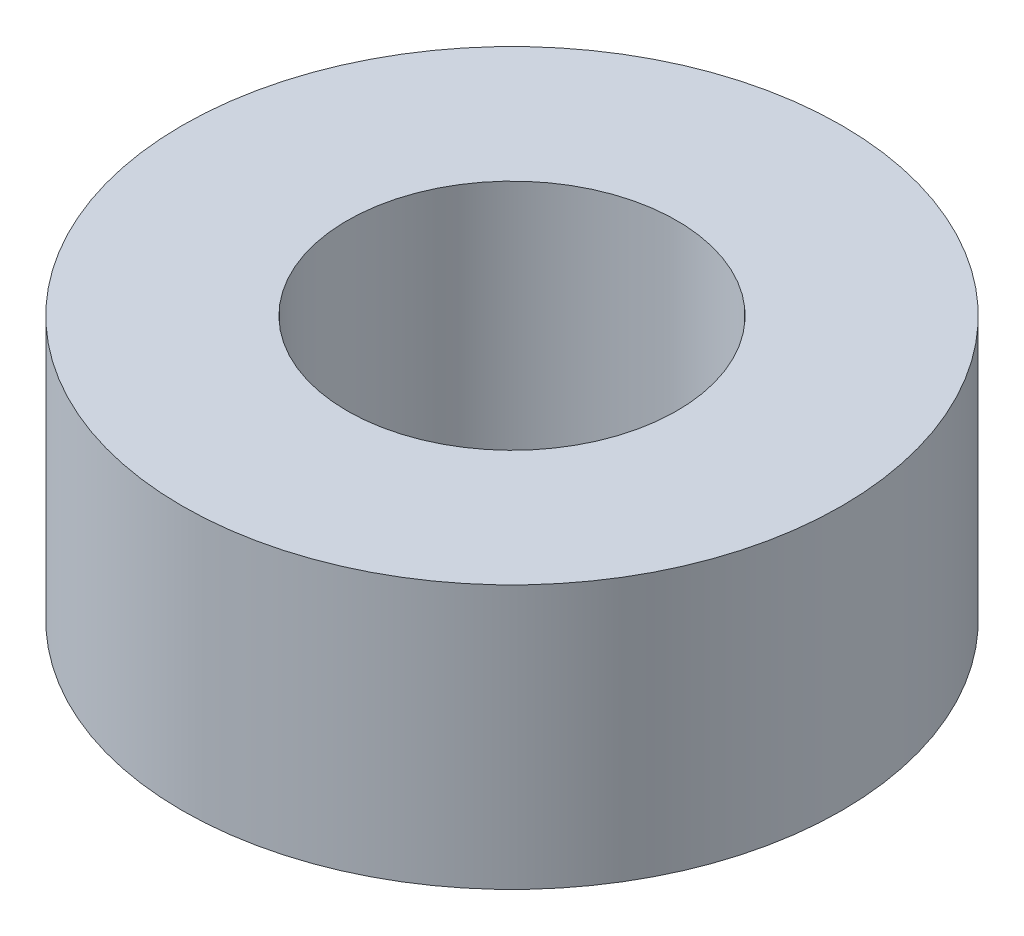
ISO-10303-21;
HEADER;
FILE_DESCRIPTION(('STEP AP214'),'2;1');
FILE_NAME('part.step','',(''),(''),'','','');
FILE_SCHEMA(('AUTOMOTIVE_DESIGN { 1 0 10303 214 1 1 1 1 }'));
ENDSEC;
DATA;
#1=APPLICATION_CONTEXT('core data for automotive mechanical design processes');
#2=APPLICATION_PROTOCOL_DEFINITION('international standard','automotive_design',2000,#1);
#3=PRODUCT_CONTEXT('',#1,'mechanical');
#4=PRODUCT('Part','Part','',(#3));
#5=PRODUCT_RELATED_PRODUCT_CATEGORY('part','',(#4));
#6=PRODUCT_DEFINITION_FORMATION('','',#4);
#7=PRODUCT_DEFINITION_CONTEXT('part definition',#1,'design');
#8=PRODUCT_DEFINITION('design','',#6,#7);
#9=PRODUCT_DEFINITION_SHAPE('','',#8);
#10=(LENGTH_UNIT() NAMED_UNIT(*) SI_UNIT(.MILLI.,.METRE.));
#11=(NAMED_UNIT(*) PLANE_ANGLE_UNIT() SI_UNIT($,.RADIAN.));
#12=(NAMED_UNIT(*) SI_UNIT($,.STERADIAN.) SOLID_ANGLE_UNIT());
#13=UNCERTAINTY_MEASURE_WITH_UNIT(LENGTH_MEASURE(1.E-05),#10,'distance_accuracy_value','');
#14=(GEOMETRIC_REPRESENTATION_CONTEXT(3) GLOBAL_UNCERTAINTY_ASSIGNED_CONTEXT((#13)) GLOBAL_UNIT_ASSIGNED_CONTEXT((#10,
#11,#12)) REPRESENTATION_CONTEXT('',''));
#15=CARTESIAN_POINT('',(0.,0.,0.));
#16=DIRECTION('',(0.,0.,1.));
#17=DIRECTION('',(1.,0.,0.));
#18=AXIS2_PLACEMENT_3D('',#15,#16,#17);
#19=CARTESIAN_POINT('',(0.,16.,0.));
#20=DIRECTION('',(0.,-1.,0.));
#21=DIRECTION('',(0.,0.,-1.));
#22=AXIS2_PLACEMENT_3D('',#19,#20,#21);
#23=CYLINDRICAL_SURFACE('',#22,20.);
#24=CARTESIAN_POINT('',(0.,16.,0.));
#25=DIRECTION('',(0.,1.,0.));
#26=DIRECTION('',(0.,0.,1.));
#27=AXIS2_PLACEMENT_3D('',#24,#25,#26);
#28=CIRCLE('',#27,20.);
#29=CARTESIAN_POINT('',(0.,16.,20.));
#30=VERTEX_POINT('',#29);
#31=EDGE_CURVE('E10',#30,#30,#28,.T.);
#32=ORIENTED_EDGE('',*,*,#31,.F.);
#33=EDGE_LOOP('',(#32));
#34=FACE_BOUND('',#33,.T.);
#35=CARTESIAN_POINT('',(0.,0.,0.));
#36=DIRECTION('',(0.,1.,0.));
#37=DIRECTION('',(0.,0.,1.));
#38=AXIS2_PLACEMENT_3D('',#35,#36,#37);
#39=CIRCLE('',#38,20.);
#40=CARTESIAN_POINT('',(0.,0.,20.));
#41=VERTEX_POINT('',#40);
#42=EDGE_CURVE('E37',#41,#41,#39,.T.);
#43=ORIENTED_EDGE('',*,*,#42,.T.);
#44=EDGE_LOOP('',(#43));
#45=FACE_BOUND('',#44,.T.);
#46=ADVANCED_FACE('F40',(#34,#45),#23,.T.);
#47=CARTESIAN_POINT('',(0.,16.,0.));
#48=DIRECTION('',(0.,1.,0.));
#49=DIRECTION('',(0.,0.,1.));
#50=AXIS2_PLACEMENT_3D('',#47,#48,#49);
#51=PLANE('',#50);
#52=CARTESIAN_POINT('',(0.,16.,0.));
#53=DIRECTION('',(0.,1.,0.));
#54=DIRECTION('',(0.,0.,1.));
#55=AXIS2_PLACEMENT_3D('',#52,#53,#54);
#56=CIRCLE('',#55,10.);
#57=CARTESIAN_POINT('',(0.,16.,10.));
#58=VERTEX_POINT('',#57);
#59=EDGE_CURVE('E50',#58,#58,#56,.T.);
#60=ORIENTED_EDGE('',*,*,#59,.F.);
#61=EDGE_LOOP('',(#60));
#62=FACE_BOUND('',#61,.T.);
#63=ORIENTED_EDGE('',*,*,#31,.T.);
#64=EDGE_LOOP('',(#63));
#65=FACE_BOUND('',#64,.T.);
#66=ADVANCED_FACE('F59',(#62,#65),#51,.T.);
#67=CARTESIAN_POINT('',(0.,0.,0.));
#68=DIRECTION('',(0.,1.,0.));
#69=DIRECTION('',(0.,0.,1.));
#70=AXIS2_PLACEMENT_3D('',#67,#68,#69);
#71=PLANE('',#70);
#72=CARTESIAN_POINT('',(0.,0.,0.));
#73=DIRECTION('',(0.,1.,0.));
#74=DIRECTION('',(0.,0.,1.));
#75=AXIS2_PLACEMENT_3D('',#72,#73,#74);
#76=CIRCLE('',#75,10.);
#77=CARTESIAN_POINT('',(0.,0.,10.));
#78=VERTEX_POINT('',#77);
#79=EDGE_CURVE('E47',#78,#78,#76,.T.);
#80=ORIENTED_EDGE('',*,*,#79,.T.);
#81=EDGE_LOOP('',(#80));
#82=FACE_BOUND('',#81,.T.);
#83=ORIENTED_EDGE('',*,*,#42,.F.);
#84=EDGE_LOOP('',(#83));
#85=FACE_BOUND('',#84,.T.);
#86=ADVANCED_FACE('F58',(#82,#85),#71,.F.);
#87=CARTESIAN_POINT('',(0.,16.,0.));
#88=DIRECTION('',(0.,-1.,0.));
#89=DIRECTION('',(0.,0.,-1.));
#90=AXIS2_PLACEMENT_3D('',#87,#88,#89);
#91=CYLINDRICAL_SURFACE('',#90,10.);
#92=ORIENTED_EDGE('',*,*,#59,.T.);
#93=EDGE_LOOP('',(#92));
#94=FACE_BOUND('',#93,.T.);
#95=ORIENTED_EDGE('',*,*,#79,.F.);
#96=EDGE_LOOP('',(#95));
#97=FACE_BOUND('',#96,.T.);
#98=ADVANCED_FACE('F54',(#94,#97),#91,.F.);
#99=CLOSED_SHELL('',(#46,#66,#86,#98));
#100=MANIFOLD_SOLID_BREP('B2',#99);
#101=ADVANCED_BREP_SHAPE_REPRESENTATION('',(#18,#100),#14);
#102=SHAPE_DEFINITION_REPRESENTATION(#9,#101);
ENDSEC;
END-ISO-10303-21;
